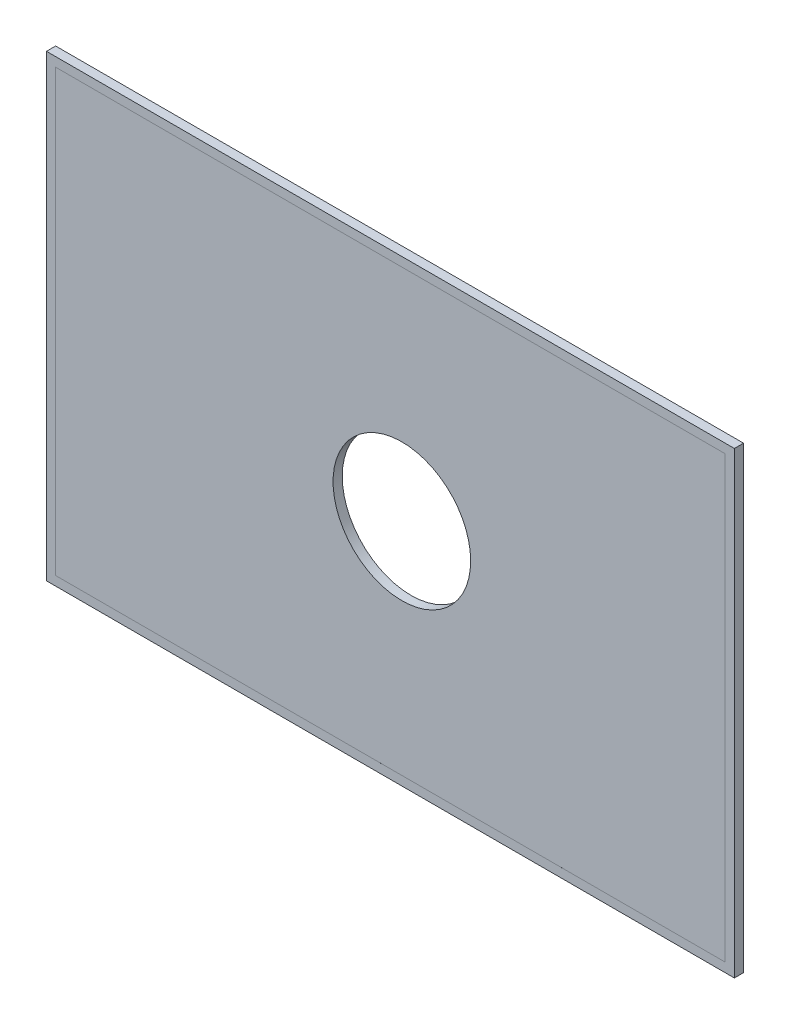
ISO-10303-21;
HEADER;
FILE_DESCRIPTION(('STEP AP214'),'2;1');
FILE_NAME('part.step','',(''),(''),'','','');
FILE_SCHEMA(('AUTOMOTIVE_DESIGN { 1 0 10303 214 1 1 1 1 }'));
ENDSEC;
DATA;
#1=APPLICATION_CONTEXT('core data for automotive mechanical design processes');
#2=APPLICATION_PROTOCOL_DEFINITION('international standard','automotive_design',2000,#1);
#3=PRODUCT_CONTEXT('',#1,'mechanical');
#4=PRODUCT('Part','Part','',(#3));
#5=PRODUCT_RELATED_PRODUCT_CATEGORY('part','',(#4));
#6=PRODUCT_DEFINITION_FORMATION('','',#4);
#7=PRODUCT_DEFINITION_CONTEXT('part definition',#1,'design');
#8=PRODUCT_DEFINITION('design','',#6,#7);
#9=PRODUCT_DEFINITION_SHAPE('','',#8);
#10=(LENGTH_UNIT() NAMED_UNIT(*) SI_UNIT(.MILLI.,.METRE.));
#11=(NAMED_UNIT(*) PLANE_ANGLE_UNIT() SI_UNIT($,.RADIAN.));
#12=(NAMED_UNIT(*) SI_UNIT($,.STERADIAN.) SOLID_ANGLE_UNIT());
#13=UNCERTAINTY_MEASURE_WITH_UNIT(LENGTH_MEASURE(1.E-05),#10,'distance_accuracy_value','');
#14=(GEOMETRIC_REPRESENTATION_CONTEXT(3) GLOBAL_UNCERTAINTY_ASSIGNED_CONTEXT((#13)) GLOBAL_UNIT_ASSIGNED_CONTEXT((#10,
#11,#12)) REPRESENTATION_CONTEXT('',''));
#15=CARTESIAN_POINT('',(0.,0.,0.));
#16=DIRECTION('',(0.,0.,1.));
#17=DIRECTION('',(1.,0.,0.));
#18=AXIS2_PLACEMENT_3D('',#15,#16,#17);
#19=CARTESIAN_POINT('',(0.,0.,2.));
#20=DIRECTION('',(1.,0.,0.));
#21=DIRECTION('',(0.,0.,-1.));
#22=AXIS2_PLACEMENT_3D('',#19,#20,#21);
#23=PLANE('',#22);
#24=DIRECTION('',(0.,-1.,0.));
#25=VECTOR('',#24,1.);
#26=CARTESIAN_POINT('',(0.,0.,0.));
#27=LINE('',#26,#25);
#28=CARTESIAN_POINT('',(0.,100.,0.));
#29=VERTEX_POINT('',#28);
#30=CARTESIAN_POINT('',(0.,0.,0.));
#31=VERTEX_POINT('',#30);
#32=EDGE_CURVE('E146',#29,#31,#27,.T.);
#33=ORIENTED_EDGE('',*,*,#32,.T.);
#34=DIRECTION('',(0.,0.,-1.));
#35=VECTOR('',#34,1.);
#36=CARTESIAN_POINT('',(0.,0.,2.));
#37=LINE('',#36,#35);
#38=CARTESIAN_POINT('',(0.,0.,2.));
#39=VERTEX_POINT('',#38);
#40=EDGE_CURVE('E11',#39,#31,#37,.T.);
#41=ORIENTED_EDGE('',*,*,#40,.F.);
#42=DIRECTION('',(0.,-1.,0.));
#43=VECTOR('',#42,1.);
#44=CARTESIAN_POINT('',(0.,0.,2.));
#45=LINE('',#44,#43);
#46=CARTESIAN_POINT('',(0.,100.,2.));
#47=VERTEX_POINT('',#46);
#48=EDGE_CURVE('E150',#47,#39,#45,.T.);
#49=ORIENTED_EDGE('',*,*,#48,.F.);
#50=DIRECTION('',(0.,0.,-1.));
#51=VECTOR('',#50,1.);
#52=CARTESIAN_POINT('',(0.,100.,2.));
#53=LINE('',#52,#51);
#54=EDGE_CURVE('E156',#47,#29,#53,.T.);
#55=ORIENTED_EDGE('',*,*,#54,.T.);
#56=EDGE_LOOP('',(#33,#41,#49,#55));
#57=FACE_BOUND('',#56,.T.);
#58=ADVANCED_FACE('F35',(#57),#23,.F.);
#59=CARTESIAN_POINT('',(0.,0.,2.));
#60=DIRECTION('',(0.,1.,0.));
#61=DIRECTION('',(0.,0.,1.));
#62=AXIS2_PLACEMENT_3D('',#59,#60,#61);
#63=PLANE('',#62);
#64=DIRECTION('',(1.,0.,0.));
#65=VECTOR('',#64,1.);
#66=CARTESIAN_POINT('',(0.,0.,0.));
#67=LINE('',#66,#65);
#68=CARTESIAN_POINT('',(150.,0.,0.));
#69=VERTEX_POINT('',#68);
#70=EDGE_CURVE('E159',#31,#69,#67,.T.);
#71=ORIENTED_EDGE('',*,*,#70,.T.);
#72=DIRECTION('',(0.,0.,-1.));
#73=VECTOR('',#72,1.);
#74=CARTESIAN_POINT('',(150.,0.,2.));
#75=LINE('',#74,#73);
#76=CARTESIAN_POINT('',(150.,0.,2.));
#77=VERTEX_POINT('',#76);
#78=EDGE_CURVE('E42',#77,#69,#75,.T.);
#79=ORIENTED_EDGE('',*,*,#78,.F.);
#80=DIRECTION('',(1.,0.,0.));
#81=VECTOR('',#80,1.);
#82=CARTESIAN_POINT('',(0.,0.,2.));
#83=LINE('',#82,#81);
#84=EDGE_CURVE('E86',#39,#77,#83,.T.);
#85=ORIENTED_EDGE('',*,*,#84,.F.);
#86=ORIENTED_EDGE('',*,*,#40,.T.);
#87=EDGE_LOOP('',(#71,#79,#85,#86));
#88=FACE_BOUND('',#87,.T.);
#89=ADVANCED_FACE('F188',(#88),#63,.F.);
#90=CARTESIAN_POINT('',(150.,0.,2.));
#91=DIRECTION('',(-1.,0.,0.));
#92=DIRECTION('',(0.,0.,1.));
#93=AXIS2_PLACEMENT_3D('',#90,#91,#92);
#94=PLANE('',#93);
#95=DIRECTION('',(0.,1.,0.));
#96=VECTOR('',#95,1.);
#97=CARTESIAN_POINT('',(150.,0.,0.));
#98=LINE('',#97,#96);
#99=CARTESIAN_POINT('',(150.,100.,0.));
#100=VERTEX_POINT('',#99);
#101=EDGE_CURVE('E161',#69,#100,#98,.T.);
#102=ORIENTED_EDGE('',*,*,#101,.T.);
#103=DIRECTION('',(0.,0.,-1.));
#104=VECTOR('',#103,1.);
#105=CARTESIAN_POINT('',(150.,100.,2.));
#106=LINE('',#105,#104);
#107=CARTESIAN_POINT('',(150.,100.,2.));
#108=VERTEX_POINT('',#107);
#109=EDGE_CURVE('E165',#108,#100,#106,.T.);
#110=ORIENTED_EDGE('',*,*,#109,.F.);
#111=DIRECTION('',(0.,1.,0.));
#112=VECTOR('',#111,1.);
#113=CARTESIAN_POINT('',(150.,0.,2.));
#114=LINE('',#113,#112);
#115=EDGE_CURVE('E153',#77,#108,#114,.T.);
#116=ORIENTED_EDGE('',*,*,#115,.F.);
#117=ORIENTED_EDGE('',*,*,#78,.T.);
#118=EDGE_LOOP('',(#102,#110,#116,#117));
#119=FACE_BOUND('',#118,.T.);
#120=ADVANCED_FACE('F170',(#119),#94,.F.);
#121=CARTESIAN_POINT('',(0.,100.,2.));
#122=DIRECTION('',(0.,-1.,0.));
#123=DIRECTION('',(0.,0.,-1.));
#124=AXIS2_PLACEMENT_3D('',#121,#122,#123);
#125=PLANE('',#124);
#126=DIRECTION('',(-1.,0.,0.));
#127=VECTOR('',#126,1.);
#128=CARTESIAN_POINT('',(0.,100.,0.));
#129=LINE('',#128,#127);
#130=EDGE_CURVE('E79',#100,#29,#129,.T.);
#131=ORIENTED_EDGE('',*,*,#130,.T.);
#132=ORIENTED_EDGE('',*,*,#54,.F.);
#133=DIRECTION('',(-1.,0.,0.));
#134=VECTOR('',#133,1.);
#135=CARTESIAN_POINT('',(0.,100.,2.));
#136=LINE('',#135,#134);
#137=EDGE_CURVE('E58',#108,#47,#136,.T.);
#138=ORIENTED_EDGE('',*,*,#137,.F.);
#139=ORIENTED_EDGE('',*,*,#109,.T.);
#140=EDGE_LOOP('',(#131,#132,#138,#139));
#141=FACE_BOUND('',#140,.T.);
#142=ADVANCED_FACE('F178',(#141),#125,.F.);
#143=CARTESIAN_POINT('',(0.,0.,2.));
#144=DIRECTION('',(0.,0.,-1.));
#145=DIRECTION('',(-1.,0.,0.));
#146=AXIS2_PLACEMENT_3D('',#143,#144,#145);
#147=PLANE('',#146);
#148=DIRECTION('',(-1.,0.,0.));
#149=VECTOR('',#148,1.);
#150=CARTESIAN_POINT('',(148.,98.,2.));
#151=LINE('',#150,#149);
#152=CARTESIAN_POINT('',(148.,98.,2.));
#153=VERTEX_POINT('',#152);
#154=CARTESIAN_POINT('',(2.,98.,2.));
#155=VERTEX_POINT('',#154);
#156=EDGE_CURVE('E140',#153,#155,#151,.T.);
#157=ORIENTED_EDGE('',*,*,#156,.F.);
#158=DIRECTION('',(0.,1.,0.));
#159=VECTOR('',#158,1.);
#160=CARTESIAN_POINT('',(148.,98.,2.));
#161=LINE('',#160,#159);
#162=CARTESIAN_POINT('',(148.,2.,2.));
#163=VERTEX_POINT('',#162);
#164=EDGE_CURVE('E49',#163,#153,#161,.T.);
#165=ORIENTED_EDGE('',*,*,#164,.F.);
#166=DIRECTION('',(1.,0.,0.));
#167=VECTOR('',#166,1.);
#168=CARTESIAN_POINT('',(148.,2.,2.));
#169=LINE('',#168,#167);
#170=CARTESIAN_POINT('',(2.,1.99999999999998,2.));
#171=VERTEX_POINT('',#170);
#172=EDGE_CURVE('E128',#171,#163,#169,.T.);
#173=ORIENTED_EDGE('',*,*,#172,.F.);
#174=DIRECTION('',(0.,-1.,0.));
#175=VECTOR('',#174,1.);
#176=CARTESIAN_POINT('',(2.,98.,2.));
#177=LINE('',#176,#175);
#178=EDGE_CURVE('E131',#155,#171,#177,.T.);
#179=ORIENTED_EDGE('',*,*,#178,.F.);
#180=EDGE_LOOP('',(#157,#165,#173,#179));
#181=FACE_BOUND('',#180,.T.);
#182=ORIENTED_EDGE('',*,*,#48,.T.);
#183=ORIENTED_EDGE('',*,*,#84,.T.);
#184=ORIENTED_EDGE('',*,*,#115,.T.);
#185=ORIENTED_EDGE('',*,*,#137,.T.);
#186=EDGE_LOOP('',(#182,#183,#184,#185));
#187=FACE_BOUND('',#186,.T.);
#188=ADVANCED_FACE('F180',(#181,#187),#147,.F.);
#189=CARTESIAN_POINT('',(0.,0.,0.));
#190=DIRECTION('',(0.,0.,-1.));
#191=DIRECTION('',(-1.,0.,0.));
#192=AXIS2_PLACEMENT_3D('',#189,#190,#191);
#193=PLANE('',#192);
#194=CARTESIAN_POINT('',(77.5,50.,0.));
#195=DIRECTION('',(0.,0.,-1.));
#196=DIRECTION('',(-1.,0.,0.));
#197=AXIS2_PLACEMENT_3D('',#194,#195,#196);
#198=CIRCLE('',#197,15.);
#199=CARTESIAN_POINT('',(62.5,50.,0.));
#200=VERTEX_POINT('',#199);
#201=EDGE_CURVE('E134',#200,#200,#198,.T.);
#202=ORIENTED_EDGE('',*,*,#201,.F.);
#203=EDGE_LOOP('',(#202));
#204=FACE_BOUND('',#203,.T.);
#205=ORIENTED_EDGE('',*,*,#32,.F.);
#206=ORIENTED_EDGE('',*,*,#130,.F.);
#207=ORIENTED_EDGE('',*,*,#101,.F.);
#208=ORIENTED_EDGE('',*,*,#70,.F.);
#209=EDGE_LOOP('',(#205,#206,#207,#208));
#210=FACE_BOUND('',#209,.T.);
#211=ADVANCED_FACE('F174',(#204,#210),#193,.T.);
#212=CARTESIAN_POINT('',(148.,98.,1.9999));
#213=DIRECTION('',(1.,0.,0.));
#214=DIRECTION('',(0.,0.,-1.));
#215=AXIS2_PLACEMENT_3D('',#212,#213,#214);
#216=PLANE('',#215);
#217=ORIENTED_EDGE('',*,*,#164,.T.);
#218=DIRECTION('',(0.,0.,1.));
#219=VECTOR('',#218,1.);
#220=CARTESIAN_POINT('',(148.,98.,1.9999));
#221=LINE('',#220,#219);
#222=CARTESIAN_POINT('',(148.,98.,1.9999));
#223=VERTEX_POINT('',#222);
#224=EDGE_CURVE('E106',#223,#153,#221,.T.);
#225=ORIENTED_EDGE('',*,*,#224,.F.);
#226=DIRECTION('',(0.,1.,0.));
#227=VECTOR('',#226,1.);
#228=CARTESIAN_POINT('',(148.,98.,1.9999));
#229=LINE('',#228,#227);
#230=CARTESIAN_POINT('',(148.,2.,1.9999));
#231=VERTEX_POINT('',#230);
#232=EDGE_CURVE('E110',#231,#223,#229,.T.);
#233=ORIENTED_EDGE('',*,*,#232,.F.);
#234=DIRECTION('',(0.,0.,1.));
#235=VECTOR('',#234,1.);
#236=CARTESIAN_POINT('',(148.,2.,1.9999));
#237=LINE('',#236,#235);
#238=EDGE_CURVE('E144',#231,#163,#237,.T.);
#239=ORIENTED_EDGE('',*,*,#238,.T.);
#240=EDGE_LOOP('',(#217,#225,#233,#239));
#241=FACE_BOUND('',#240,.T.);
#242=ADVANCED_FACE('F108',(#241),#216,.F.);
#243=CARTESIAN_POINT('',(148.,2.,1.9999));
#244=DIRECTION('',(0.,-1.,0.));
#245=DIRECTION('',(1.,0.,0.));
#246=AXIS2_PLACEMENT_3D('',#243,#244,#245);
#247=PLANE('',#246);
#248=ORIENTED_EDGE('',*,*,#172,.T.);
#249=ORIENTED_EDGE('',*,*,#238,.F.);
#250=DIRECTION('',(1.,0.,0.));
#251=VECTOR('',#250,1.);
#252=CARTESIAN_POINT('',(148.,2.,1.9999));
#253=LINE('',#252,#251);
#254=CARTESIAN_POINT('',(2.,1.99999999999998,1.9999));
#255=VERTEX_POINT('',#254);
#256=EDGE_CURVE('E116',#255,#231,#253,.T.);
#257=ORIENTED_EDGE('',*,*,#256,.F.);
#258=DIRECTION('',(0.,0.,1.));
#259=VECTOR('',#258,1.);
#260=CARTESIAN_POINT('',(2.,1.99999999999998,1.9999));
#261=LINE('',#260,#259);
#262=EDGE_CURVE('E147',#255,#171,#261,.T.);
#263=ORIENTED_EDGE('',*,*,#262,.T.);
#264=EDGE_LOOP('',(#248,#249,#257,#263));
#265=FACE_BOUND('',#264,.T.);
#266=ADVANCED_FACE('F222',(#265),#247,.F.);
#267=CARTESIAN_POINT('',(2.,98.,1.9999));
#268=DIRECTION('',(-1.,0.,0.));
#269=DIRECTION('',(0.,0.,1.));
#270=AXIS2_PLACEMENT_3D('',#267,#268,#269);
#271=PLANE('',#270);
#272=ORIENTED_EDGE('',*,*,#178,.T.);
#273=ORIENTED_EDGE('',*,*,#262,.F.);
#274=DIRECTION('',(0.,-1.,0.));
#275=VECTOR('',#274,1.);
#276=CARTESIAN_POINT('',(2.,98.,1.9999));
#277=LINE('',#276,#275);
#278=CARTESIAN_POINT('',(2.,98.,1.9999));
#279=VERTEX_POINT('',#278);
#280=EDGE_CURVE('E124',#279,#255,#277,.T.);
#281=ORIENTED_EDGE('',*,*,#280,.F.);
#282=DIRECTION('',(0.,0.,1.));
#283=VECTOR('',#282,1.);
#284=CARTESIAN_POINT('',(2.,98.,1.9999));
#285=LINE('',#284,#283);
#286=EDGE_CURVE('E115',#279,#155,#285,.T.);
#287=ORIENTED_EDGE('',*,*,#286,.T.);
#288=EDGE_LOOP('',(#272,#273,#281,#287));
#289=FACE_BOUND('',#288,.T.);
#290=ADVANCED_FACE('F231',(#289),#271,.F.);
#291=CARTESIAN_POINT('',(148.,98.,1.9999));
#292=DIRECTION('',(0.,1.,0.));
#293=DIRECTION('',(-1.,0.,0.));
#294=AXIS2_PLACEMENT_3D('',#291,#292,#293);
#295=PLANE('',#294);
#296=ORIENTED_EDGE('',*,*,#156,.T.);
#297=ORIENTED_EDGE('',*,*,#286,.F.);
#298=DIRECTION('',(-1.,0.,0.));
#299=VECTOR('',#298,1.);
#300=CARTESIAN_POINT('',(148.,98.,1.9999));
#301=LINE('',#300,#299);
#302=EDGE_CURVE('E119',#223,#279,#301,.T.);
#303=ORIENTED_EDGE('',*,*,#302,.F.);
#304=ORIENTED_EDGE('',*,*,#224,.T.);
#305=EDGE_LOOP('',(#296,#297,#303,#304));
#306=FACE_BOUND('',#305,.T.);
#307=ADVANCED_FACE('F120',(#306),#295,.F.);
#308=CARTESIAN_POINT('',(0.,0.,1.9999));
#309=DIRECTION('',(0.,0.,-1.));
#310=DIRECTION('',(-1.,0.,0.));
#311=AXIS2_PLACEMENT_3D('',#308,#309,#310);
#312=PLANE('',#311);
#313=CARTESIAN_POINT('',(77.5,50.,1.9999));
#314=DIRECTION('',(0.,0.,1.));
#315=DIRECTION('',(1.,0.,0.));
#316=AXIS2_PLACEMENT_3D('',#313,#314,#315);
#317=CIRCLE('',#316,15.);
#318=CARTESIAN_POINT('',(92.5,50.,1.9999));
#319=VERTEX_POINT('',#318);
#320=EDGE_CURVE('E283',#319,#319,#317,.T.);
#321=ORIENTED_EDGE('',*,*,#320,.F.);
#322=EDGE_LOOP('',(#321));
#323=FACE_BOUND('',#322,.T.);
#324=ORIENTED_EDGE('',*,*,#232,.T.);
#325=ORIENTED_EDGE('',*,*,#302,.T.);
#326=ORIENTED_EDGE('',*,*,#280,.T.);
#327=ORIENTED_EDGE('',*,*,#256,.T.);
#328=EDGE_LOOP('',(#324,#325,#326,#327));
#329=FACE_BOUND('',#328,.T.);
#330=ADVANCED_FACE('F126',(#323,#329),#312,.F.);
#331=CARTESIAN_POINT('',(77.5,50.,-0.5001));
#332=DIRECTION('',(0.,0.,1.));
#333=DIRECTION('',(1.,0.,0.));
#334=AXIS2_PLACEMENT_3D('',#331,#332,#333);
#335=CYLINDRICAL_SURFACE('',#334,15.);
#336=ORIENTED_EDGE('',*,*,#201,.T.);
#337=EDGE_LOOP('',(#336));
#338=FACE_BOUND('',#337,.T.);
#339=ORIENTED_EDGE('',*,*,#320,.T.);
#340=EDGE_LOOP('',(#339));
#341=FACE_BOUND('',#340,.T.);
#342=ADVANCED_FACE('F264',(#338,#341),#335,.F.);
#343=CLOSED_SHELL('',(#58,#89,#120,#142,#188,#211,#242,#266,#290,#307,#330,#342));
#344=MANIFOLD_SOLID_BREP('B2',#343);
#345=ADVANCED_BREP_SHAPE_REPRESENTATION('',(#18,#344),#14);
#346=SHAPE_DEFINITION_REPRESENTATION(#9,#345);
ENDSEC;
END-ISO-10303-21;
